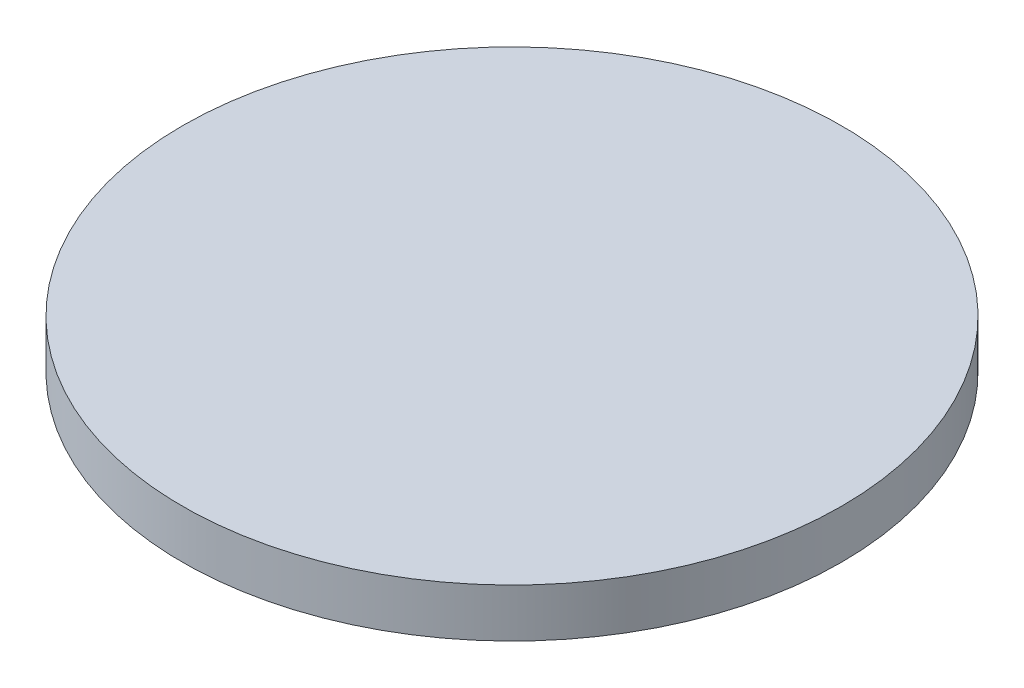
ISO-10303-21;
HEADER;
FILE_DESCRIPTION(('STEP AP214'),'2;1');
FILE_NAME('part.step','',(''),(''),'','','');
FILE_SCHEMA(('AUTOMOTIVE_DESIGN { 1 0 10303 214 1 1 1 1 }'));
ENDSEC;
DATA;
#1=APPLICATION_CONTEXT('core data for automotive mechanical design processes');
#2=APPLICATION_PROTOCOL_DEFINITION('international standard','automotive_design',2000,#1);
#3=PRODUCT_CONTEXT('',#1,'mechanical');
#4=PRODUCT('Part','Part','',(#3));
#5=PRODUCT_RELATED_PRODUCT_CATEGORY('part','',(#4));
#6=PRODUCT_DEFINITION_FORMATION('','',#4);
#7=PRODUCT_DEFINITION_CONTEXT('part definition',#1,'design');
#8=PRODUCT_DEFINITION('design','',#6,#7);
#9=PRODUCT_DEFINITION_SHAPE('','',#8);
#10=(LENGTH_UNIT() NAMED_UNIT(*) SI_UNIT(.MILLI.,.METRE.));
#11=(NAMED_UNIT(*) PLANE_ANGLE_UNIT() SI_UNIT($,.RADIAN.));
#12=(NAMED_UNIT(*) SI_UNIT($,.STERADIAN.) SOLID_ANGLE_UNIT());
#13=UNCERTAINTY_MEASURE_WITH_UNIT(LENGTH_MEASURE(1.E-05),#10,'distance_accuracy_value','');
#14=(GEOMETRIC_REPRESENTATION_CONTEXT(3) GLOBAL_UNCERTAINTY_ASSIGNED_CONTEXT((#13)) GLOBAL_UNIT_ASSIGNED_CONTEXT((#10,
#11,#12)) REPRESENTATION_CONTEXT('',''));
#15=CARTESIAN_POINT('',(0.,0.,0.));
#16=DIRECTION('',(0.,0.,1.));
#17=DIRECTION('',(1.,0.,0.));
#18=AXIS2_PLACEMENT_3D('',#15,#16,#17);
#19=CARTESIAN_POINT('',(0.,8.1,0.));
#20=DIRECTION('',(0.,-1.,0.));
#21=DIRECTION('',(1.,0.,0.));
#22=AXIS2_PLACEMENT_3D('',#19,#20,#21);
#23=PLANE('',#22);
#24=CARTESIAN_POINT('',(0.,8.09999999999999,0.));
#25=DIRECTION('',(0.,-1.,0.));
#26=DIRECTION('',(1.,0.,0.));
#27=AXIS2_PLACEMENT_3D('',#24,#25,#26);
#28=CIRCLE('',#27,55.);
#29=CARTESIAN_POINT('',(55.,8.09999999999999,0.));
#30=VERTEX_POINT('',#29);
#31=EDGE_CURVE('E10',#30,#30,#28,.T.);
#32=ORIENTED_EDGE('',*,*,#31,.F.);
#33=EDGE_LOOP('',(#32));
#34=FACE_BOUND('',#33,.T.);
#35=ADVANCED_FACE('F35',(#34),#23,.F.);
#36=CARTESIAN_POINT('',(0.,0.,0.));
#37=DIRECTION('',(0.,-1.,0.));
#38=DIRECTION('',(1.,0.,0.));
#39=AXIS2_PLACEMENT_3D('',#36,#37,#38);
#40=CYLINDRICAL_SURFACE('',#39,55.);
#41=ORIENTED_EDGE('',*,*,#31,.T.);
#42=EDGE_LOOP('',(#41));
#43=FACE_BOUND('',#42,.T.);
#44=CARTESIAN_POINT('',(0.,0.,0.));
#45=DIRECTION('',(0.,-1.,0.));
#46=DIRECTION('',(1.,0.,0.));
#47=AXIS2_PLACEMENT_3D('',#44,#45,#46);
#48=CIRCLE('',#47,55.);
#49=CARTESIAN_POINT('',(55.,0.,0.));
#50=VERTEX_POINT('',#49);
#51=EDGE_CURVE('E41',#50,#50,#48,.T.);
#52=ORIENTED_EDGE('',*,*,#51,.F.);
#53=EDGE_LOOP('',(#52));
#54=FACE_BOUND('',#53,.T.);
#55=ADVANCED_FACE('F49',(#43,#54),#40,.T.);
#56=CARTESIAN_POINT('',(0.,0.,0.));
#57=DIRECTION('',(0.,-1.,0.));
#58=DIRECTION('',(1.,0.,0.));
#59=AXIS2_PLACEMENT_3D('',#56,#57,#58);
#60=PLANE('',#59);
#61=ORIENTED_EDGE('',*,*,#51,.T.);
#62=EDGE_LOOP('',(#61));
#63=FACE_BOUND('',#62,.T.);
#64=ADVANCED_FACE('F47',(#63),#60,.T.);
#65=CLOSED_SHELL('',(#35,#55,#64));
#66=MANIFOLD_SOLID_BREP('B2',#65);
#67=ADVANCED_BREP_SHAPE_REPRESENTATION('',(#18,#66),#14);
#68=SHAPE_DEFINITION_REPRESENTATION(#9,#67);
ENDSEC;
END-ISO-10303-21;
